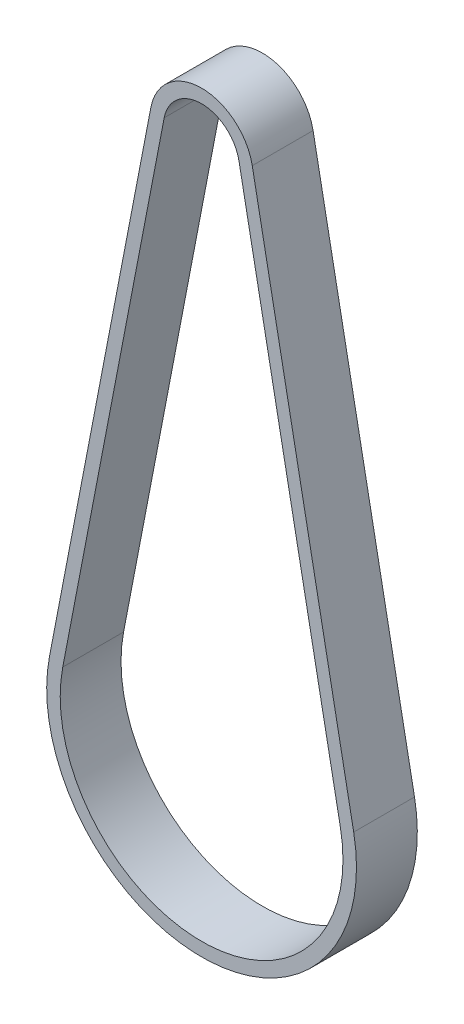
ISO-10303-21;
HEADER;
FILE_DESCRIPTION(('STEP AP214'),'2;1');
FILE_NAME('part.step','',(''),(''),'','','');
FILE_SCHEMA(('AUTOMOTIVE_DESIGN { 1 0 10303 214 1 1 1 1 }'));
ENDSEC;
DATA;
#1=APPLICATION_CONTEXT('core data for automotive mechanical design processes');
#2=APPLICATION_PROTOCOL_DEFINITION('international standard','automotive_design',2000,#1);
#3=PRODUCT_CONTEXT('',#1,'mechanical');
#4=PRODUCT('Part','Part','',(#3));
#5=PRODUCT_RELATED_PRODUCT_CATEGORY('part','',(#4));
#6=PRODUCT_DEFINITION_FORMATION('','',#4);
#7=PRODUCT_DEFINITION_CONTEXT('part definition',#1,'design');
#8=PRODUCT_DEFINITION('design','',#6,#7);
#9=PRODUCT_DEFINITION_SHAPE('','',#8);
#10=(LENGTH_UNIT() NAMED_UNIT(*) SI_UNIT(.MILLI.,.METRE.));
#11=(NAMED_UNIT(*) PLANE_ANGLE_UNIT() SI_UNIT($,.RADIAN.));
#12=(NAMED_UNIT(*) SI_UNIT($,.STERADIAN.) SOLID_ANGLE_UNIT());
#13=UNCERTAINTY_MEASURE_WITH_UNIT(LENGTH_MEASURE(1.E-05),#10,'distance_accuracy_value','');
#14=(GEOMETRIC_REPRESENTATION_CONTEXT(3) GLOBAL_UNCERTAINTY_ASSIGNED_CONTEXT((#13)) GLOBAL_UNIT_ASSIGNED_CONTEXT((#10,
#11,#12)) REPRESENTATION_CONTEXT('',''));
#15=CARTESIAN_POINT('',(0.,0.,0.));
#16=DIRECTION('',(0.,0.,1.));
#17=DIRECTION('',(1.,0.,0.));
#18=AXIS2_PLACEMENT_3D('',#15,#16,#17);
#19=CARTESIAN_POINT('',(0.,0.,4.5));
#20=DIRECTION('',(0.,0.,1.));
#21=DIRECTION('',(1.,0.,0.));
#22=AXIS2_PLACEMENT_3D('',#19,#20,#21);
#23=PLANE('',#22);
#24=CARTESIAN_POINT('',(0.,0.,4.5));
#25=DIRECTION('',(0.,0.,1.));
#26=DIRECTION('',(1.,0.,0.));
#27=AXIS2_PLACEMENT_3D('',#24,#25,#26);
#28=CIRCLE('',#27,7.635);
#29=CARTESIAN_POINT('',(7.49710952212136,1.44449777200149,4.5));
#30=VERTEX_POINT('',#29);
#31=CARTESIAN_POINT('',(-7.49710952212136,1.44449777200149,4.5));
#32=VERTEX_POINT('',#31);
#33=EDGE_CURVE('E166',#30,#32,#28,.T.);
#34=ORIENTED_EDGE('',*,*,#33,.T.);
#35=DIRECTION('',(-0.189194207203862,-0.981939688555515,0.));
#36=VECTOR('',#35,1.);
#37=CARTESIAN_POINT('',(-7.49710952212136,1.44449777200149,4.5));
#38=LINE('',#37,#36);
#39=CARTESIAN_POINT('',(-22.5060576616924,-76.4536687708875,4.5));
#40=VERTEX_POINT('',#39);
#41=EDGE_CURVE('E169',#32,#40,#38,.T.);
#42=ORIENTED_EDGE('',*,*,#41,.T.);
#43=CARTESIAN_POINT('',(0.,-80.79,4.5));
#44=DIRECTION('',(0.,0.,1.));
#45=DIRECTION('',(1.,0.,0.));
#46=AXIS2_PLACEMENT_3D('',#43,#44,#45);
#47=CIRCLE('',#46,22.92);
#48=CARTESIAN_POINT('',(22.5060576616924,-76.4536687708875,4.5));
#49=VERTEX_POINT('',#48);
#50=EDGE_CURVE('E172',#40,#49,#47,.T.);
#51=ORIENTED_EDGE('',*,*,#50,.T.);
#52=DIRECTION('',(-0.189194207203862,0.981939688555515,0.));
#53=VECTOR('',#52,1.);
#54=CARTESIAN_POINT('',(7.49710952212136,1.44449777200149,4.5));
#55=LINE('',#54,#53);
#56=EDGE_CURVE('E174',#49,#30,#55,.T.);
#57=ORIENTED_EDGE('',*,*,#56,.T.);
#58=EDGE_LOOP('',(#34,#42,#51,#57));
#59=FACE_BOUND('',#58,.T.);
#60=DIRECTION('',(-0.189194207203862,-0.981939688555515,0.));
#61=VECTOR('',#60,1.);
#62=CARTESIAN_POINT('',(-5.53323014501033,1.06610935759376,4.5));
#63=LINE('',#62,#61);
#64=CARTESIAN_POINT('',(-5.53323014501033,1.06610935759376,4.5));
#65=VERTEX_POINT('',#64);
#66=CARTESIAN_POINT('',(-20.5421782845814,-76.8320571852952,4.5));
#67=VERTEX_POINT('',#66);
#68=EDGE_CURVE('E138',#65,#67,#63,.T.);
#69=ORIENTED_EDGE('',*,*,#68,.F.);
#70=CARTESIAN_POINT('',(0.,0.,4.5));
#71=DIRECTION('',(0.,0.,1.));
#72=DIRECTION('',(1.,0.,0.));
#73=AXIS2_PLACEMENT_3D('',#70,#71,#72);
#74=CIRCLE('',#73,5.635);
#75=CARTESIAN_POINT('',(5.53323014501033,1.06610935759376,4.5));
#76=VERTEX_POINT('',#75);
#77=EDGE_CURVE('E130',#76,#65,#74,.T.);
#78=ORIENTED_EDGE('',*,*,#77,.F.);
#79=DIRECTION('',(-0.189194207203862,0.981939688555515,0.));
#80=VECTOR('',#79,1.);
#81=CARTESIAN_POINT('',(5.53323014501033,1.06610935759376,4.5));
#82=LINE('',#81,#80);
#83=CARTESIAN_POINT('',(20.5421782845814,-76.8320571852952,4.5));
#84=VERTEX_POINT('',#83);
#85=EDGE_CURVE('E152',#84,#76,#82,.T.);
#86=ORIENTED_EDGE('',*,*,#85,.F.);
#87=CARTESIAN_POINT('',(0.,-80.79,4.5));
#88=DIRECTION('',(0.,0.,1.));
#89=DIRECTION('',(1.,0.,0.));
#90=AXIS2_PLACEMENT_3D('',#87,#88,#89);
#91=CIRCLE('',#90,20.92);
#92=EDGE_CURVE('E150',#67,#84,#91,.T.);
#93=ORIENTED_EDGE('',*,*,#92,.F.);
#94=EDGE_LOOP('',(#69,#78,#86,#93));
#95=FACE_BOUND('',#94,.T.);
#96=ADVANCED_FACE('F65',(#59,#95),#23,.T.);
#97=CARTESIAN_POINT('',(0.,0.,-4.5));
#98=DIRECTION('',(0.,0.,1.));
#99=DIRECTION('',(1.,0.,0.));
#100=AXIS2_PLACEMENT_3D('',#97,#98,#99);
#101=PLANE('',#100);
#102=CARTESIAN_POINT('',(0.,0.,-4.5));
#103=DIRECTION('',(0.,0.,1.));
#104=DIRECTION('',(1.,0.,0.));
#105=AXIS2_PLACEMENT_3D('',#102,#103,#104);
#106=CIRCLE('',#105,7.635);
#107=CARTESIAN_POINT('',(7.49710952212136,1.44449777200149,-4.5));
#108=VERTEX_POINT('',#107);
#109=CARTESIAN_POINT('',(-7.49710952212136,1.44449777200149,-4.5));
#110=VERTEX_POINT('',#109);
#111=EDGE_CURVE('E146',#108,#110,#106,.T.);
#112=ORIENTED_EDGE('',*,*,#111,.F.);
#113=DIRECTION('',(-0.189194207203862,0.981939688555515,0.));
#114=VECTOR('',#113,1.);
#115=CARTESIAN_POINT('',(7.49710952212136,1.44449777200149,-4.5));
#116=LINE('',#115,#114);
#117=CARTESIAN_POINT('',(22.5060576616924,-76.4536687708875,-4.5));
#118=VERTEX_POINT('',#117);
#119=EDGE_CURVE('E170',#118,#108,#116,.T.);
#120=ORIENTED_EDGE('',*,*,#119,.F.);
#121=CARTESIAN_POINT('',(0.,-80.79,-4.5));
#122=DIRECTION('',(0.,0.,1.));
#123=DIRECTION('',(1.,0.,0.));
#124=AXIS2_PLACEMENT_3D('',#121,#122,#123);
#125=CIRCLE('',#124,22.92);
#126=CARTESIAN_POINT('',(-22.5060576616924,-76.4536687708875,-4.5));
#127=VERTEX_POINT('',#126);
#128=EDGE_CURVE('E181',#127,#118,#125,.T.);
#129=ORIENTED_EDGE('',*,*,#128,.F.);
#130=DIRECTION('',(-0.189194207203862,-0.981939688555515,0.));
#131=VECTOR('',#130,1.);
#132=CARTESIAN_POINT('',(-7.49710952212136,1.44449777200149,-4.5));
#133=LINE('',#132,#131);
#134=EDGE_CURVE('E179',#110,#127,#133,.T.);
#135=ORIENTED_EDGE('',*,*,#134,.F.);
#136=EDGE_LOOP('',(#112,#120,#129,#135));
#137=FACE_BOUND('',#136,.T.);
#138=CARTESIAN_POINT('',(0.,0.,-4.5));
#139=DIRECTION('',(0.,0.,1.));
#140=DIRECTION('',(1.,0.,0.));
#141=AXIS2_PLACEMENT_3D('',#138,#139,#140);
#142=CIRCLE('',#141,5.635);
#143=CARTESIAN_POINT('',(5.53323014501033,1.06610935759376,-4.5));
#144=VERTEX_POINT('',#143);
#145=CARTESIAN_POINT('',(-5.53323014501033,1.06610935759376,-4.5));
#146=VERTEX_POINT('',#145);
#147=EDGE_CURVE('E88',#144,#146,#142,.T.);
#148=ORIENTED_EDGE('',*,*,#147,.T.);
#149=DIRECTION('',(-0.189194207203862,-0.981939688555515,0.));
#150=VECTOR('',#149,1.);
#151=CARTESIAN_POINT('',(-5.53323014501033,1.06610935759376,-4.5));
#152=LINE('',#151,#150);
#153=CARTESIAN_POINT('',(-20.5421782845814,-76.8320571852952,-4.5));
#154=VERTEX_POINT('',#153);
#155=EDGE_CURVE('E145',#146,#154,#152,.T.);
#156=ORIENTED_EDGE('',*,*,#155,.T.);
#157=CARTESIAN_POINT('',(0.,-80.79,-4.5));
#158=DIRECTION('',(0.,0.,1.));
#159=DIRECTION('',(1.,0.,0.));
#160=AXIS2_PLACEMENT_3D('',#157,#158,#159);
#161=CIRCLE('',#160,20.92);
#162=CARTESIAN_POINT('',(20.5421782845814,-76.8320571852952,-4.5));
#163=VERTEX_POINT('',#162);
#164=EDGE_CURVE('E158',#154,#163,#161,.T.);
#165=ORIENTED_EDGE('',*,*,#164,.T.);
#166=DIRECTION('',(-0.189194207203862,0.981939688555515,0.));
#167=VECTOR('',#166,1.);
#168=CARTESIAN_POINT('',(5.53323014501033,1.06610935759376,-4.5));
#169=LINE('',#168,#167);
#170=EDGE_CURVE('E139',#163,#144,#169,.T.);
#171=ORIENTED_EDGE('',*,*,#170,.T.);
#172=EDGE_LOOP('',(#148,#156,#165,#171));
#173=FACE_BOUND('',#172,.T.);
#174=ADVANCED_FACE('F199',(#137,#173),#101,.F.);
#175=CARTESIAN_POINT('',(0.,0.,4.5));
#176=DIRECTION('',(0.,0.,-1.));
#177=DIRECTION('',(-1.,0.,0.));
#178=AXIS2_PLACEMENT_3D('',#175,#176,#177);
#179=CYLINDRICAL_SURFACE('',#178,7.635);
#180=ORIENTED_EDGE('',*,*,#111,.T.);
#181=DIRECTION('',(0.,0.,-1.));
#182=VECTOR('',#181,1.);
#183=CARTESIAN_POINT('',(-7.49710952212136,1.44449777200149,4.5));
#184=LINE('',#183,#182);
#185=EDGE_CURVE('E12',#32,#110,#184,.T.);
#186=ORIENTED_EDGE('',*,*,#185,.F.);
#187=ORIENTED_EDGE('',*,*,#33,.F.);
#188=DIRECTION('',(0.,0.,-1.));
#189=VECTOR('',#188,1.);
#190=CARTESIAN_POINT('',(7.49710952212136,1.44449777200149,4.5));
#191=LINE('',#190,#189);
#192=EDGE_CURVE('E176',#30,#108,#191,.T.);
#193=ORIENTED_EDGE('',*,*,#192,.T.);
#194=EDGE_LOOP('',(#180,#186,#187,#193));
#195=FACE_BOUND('',#194,.T.);
#196=ADVANCED_FACE('F67',(#195),#179,.T.);
#197=CARTESIAN_POINT('',(-7.49710952212136,1.44449777200149,4.5));
#198=DIRECTION('',(0.981939688555515,-0.189194207203862,0.));
#199=DIRECTION('',(0.189194207203862,0.981939688555515,0.));
#200=AXIS2_PLACEMENT_3D('',#197,#198,#199);
#201=PLANE('',#200);
#202=ORIENTED_EDGE('',*,*,#134,.T.);
#203=DIRECTION('',(0.,0.,-1.));
#204=VECTOR('',#203,1.);
#205=CARTESIAN_POINT('',(-22.5060576616924,-76.4536687708875,4.5));
#206=LINE('',#205,#204);
#207=EDGE_CURVE('E73',#40,#127,#206,.T.);
#208=ORIENTED_EDGE('',*,*,#207,.F.);
#209=ORIENTED_EDGE('',*,*,#41,.F.);
#210=ORIENTED_EDGE('',*,*,#185,.T.);
#211=EDGE_LOOP('',(#202,#208,#209,#210));
#212=FACE_BOUND('',#211,.T.);
#213=ADVANCED_FACE('F209',(#212),#201,.F.);
#214=CARTESIAN_POINT('',(0.,-80.79,4.5));
#215=DIRECTION('',(0.,0.,-1.));
#216=DIRECTION('',(-1.,0.,0.));
#217=AXIS2_PLACEMENT_3D('',#214,#215,#216);
#218=CYLINDRICAL_SURFACE('',#217,22.92);
#219=ORIENTED_EDGE('',*,*,#128,.T.);
#220=DIRECTION('',(0.,0.,-1.));
#221=VECTOR('',#220,1.);
#222=CARTESIAN_POINT('',(22.5060576616924,-76.4536687708875,4.5));
#223=LINE('',#222,#221);
#224=EDGE_CURVE('E186',#49,#118,#223,.T.);
#225=ORIENTED_EDGE('',*,*,#224,.F.);
#226=ORIENTED_EDGE('',*,*,#50,.F.);
#227=ORIENTED_EDGE('',*,*,#207,.T.);
#228=EDGE_LOOP('',(#219,#225,#226,#227));
#229=FACE_BOUND('',#228,.T.);
#230=ADVANCED_FACE('F193',(#229),#218,.T.);
#231=CARTESIAN_POINT('',(7.49710952212136,1.44449777200149,4.5));
#232=DIRECTION('',(-0.981939688555515,-0.189194207203862,0.));
#233=DIRECTION('',(0.189194207203862,-0.981939688555515,0.));
#234=AXIS2_PLACEMENT_3D('',#231,#232,#233);
#235=PLANE('',#234);
#236=ORIENTED_EDGE('',*,*,#119,.T.);
#237=ORIENTED_EDGE('',*,*,#192,.F.);
#238=ORIENTED_EDGE('',*,*,#56,.F.);
#239=ORIENTED_EDGE('',*,*,#224,.T.);
#240=EDGE_LOOP('',(#236,#237,#238,#239));
#241=FACE_BOUND('',#240,.T.);
#242=ADVANCED_FACE('F203',(#241),#235,.F.);
#243=CARTESIAN_POINT('',(0.,0.,4.5));
#244=DIRECTION('',(0.,0.,-1.));
#245=DIRECTION('',(-1.,0.,0.));
#246=AXIS2_PLACEMENT_3D('',#243,#244,#245);
#247=CYLINDRICAL_SURFACE('',#246,5.635);
#248=ORIENTED_EDGE('',*,*,#147,.F.);
#249=DIRECTION('',(0.,0.,-1.));
#250=VECTOR('',#249,1.);
#251=CARTESIAN_POINT('',(5.53323014501033,1.06610935759376,4.5));
#252=LINE('',#251,#250);
#253=EDGE_CURVE('E134',#76,#144,#252,.T.);
#254=ORIENTED_EDGE('',*,*,#253,.F.);
#255=ORIENTED_EDGE('',*,*,#77,.T.);
#256=DIRECTION('',(0.,0.,-1.));
#257=VECTOR('',#256,1.);
#258=CARTESIAN_POINT('',(-5.53323014501033,1.06610935759376,4.5));
#259=LINE('',#258,#257);
#260=EDGE_CURVE('E133',#65,#146,#259,.T.);
#261=ORIENTED_EDGE('',*,*,#260,.T.);
#262=EDGE_LOOP('',(#248,#254,#255,#261));
#263=FACE_BOUND('',#262,.T.);
#264=ADVANCED_FACE('F132',(#263),#247,.F.);
#265=CARTESIAN_POINT('',(-5.53323014501033,1.06610935759376,4.5));
#266=DIRECTION('',(0.981939688555515,-0.189194207203862,0.));
#267=DIRECTION('',(0.189194207203862,0.981939688555515,0.));
#268=AXIS2_PLACEMENT_3D('',#265,#266,#267);
#269=PLANE('',#268);
#270=ORIENTED_EDGE('',*,*,#155,.F.);
#271=ORIENTED_EDGE('',*,*,#260,.F.);
#272=ORIENTED_EDGE('',*,*,#68,.T.);
#273=DIRECTION('',(0.,0.,-1.));
#274=VECTOR('',#273,1.);
#275=CARTESIAN_POINT('',(-20.5421782845814,-76.8320571852952,4.5));
#276=LINE('',#275,#274);
#277=EDGE_CURVE('E147',#67,#154,#276,.T.);
#278=ORIENTED_EDGE('',*,*,#277,.T.);
#279=EDGE_LOOP('',(#270,#271,#272,#278));
#280=FACE_BOUND('',#279,.T.);
#281=ADVANCED_FACE('F142',(#280),#269,.T.);
#282=CARTESIAN_POINT('',(0.,-80.79,4.5));
#283=DIRECTION('',(0.,0.,-1.));
#284=DIRECTION('',(-1.,0.,0.));
#285=AXIS2_PLACEMENT_3D('',#282,#283,#284);
#286=CYLINDRICAL_SURFACE('',#285,20.92);
#287=ORIENTED_EDGE('',*,*,#164,.F.);
#288=ORIENTED_EDGE('',*,*,#277,.F.);
#289=ORIENTED_EDGE('',*,*,#92,.T.);
#290=DIRECTION('',(0.,0.,-1.));
#291=VECTOR('',#290,1.);
#292=CARTESIAN_POINT('',(20.5421782845814,-76.8320571852952,4.5));
#293=LINE('',#292,#291);
#294=EDGE_CURVE('E80',#84,#163,#293,.T.);
#295=ORIENTED_EDGE('',*,*,#294,.T.);
#296=EDGE_LOOP('',(#287,#288,#289,#295));
#297=FACE_BOUND('',#296,.T.);
#298=ADVANCED_FACE('F232',(#297),#286,.F.);
#299=CARTESIAN_POINT('',(5.53323014501033,1.06610935759376,4.5));
#300=DIRECTION('',(-0.981939688555515,-0.189194207203862,0.));
#301=DIRECTION('',(0.189194207203862,-0.981939688555515,0.));
#302=AXIS2_PLACEMENT_3D('',#299,#300,#301);
#303=PLANE('',#302);
#304=ORIENTED_EDGE('',*,*,#170,.F.);
#305=ORIENTED_EDGE('',*,*,#294,.F.);
#306=ORIENTED_EDGE('',*,*,#85,.T.);
#307=ORIENTED_EDGE('',*,*,#253,.T.);
#308=EDGE_LOOP('',(#304,#305,#306,#307));
#309=FACE_BOUND('',#308,.T.);
#310=ADVANCED_FACE('F236',(#309),#303,.T.);
#311=CLOSED_SHELL('',(#96,#174,#196,#213,#230,#242,#264,#281,#298,#310));
#312=MANIFOLD_SOLID_BREP('B2',#311);
#313=ADVANCED_BREP_SHAPE_REPRESENTATION('',(#18,#312),#14);
#314=SHAPE_DEFINITION_REPRESENTATION(#9,#313);
ENDSEC;
END-ISO-10303-21;
